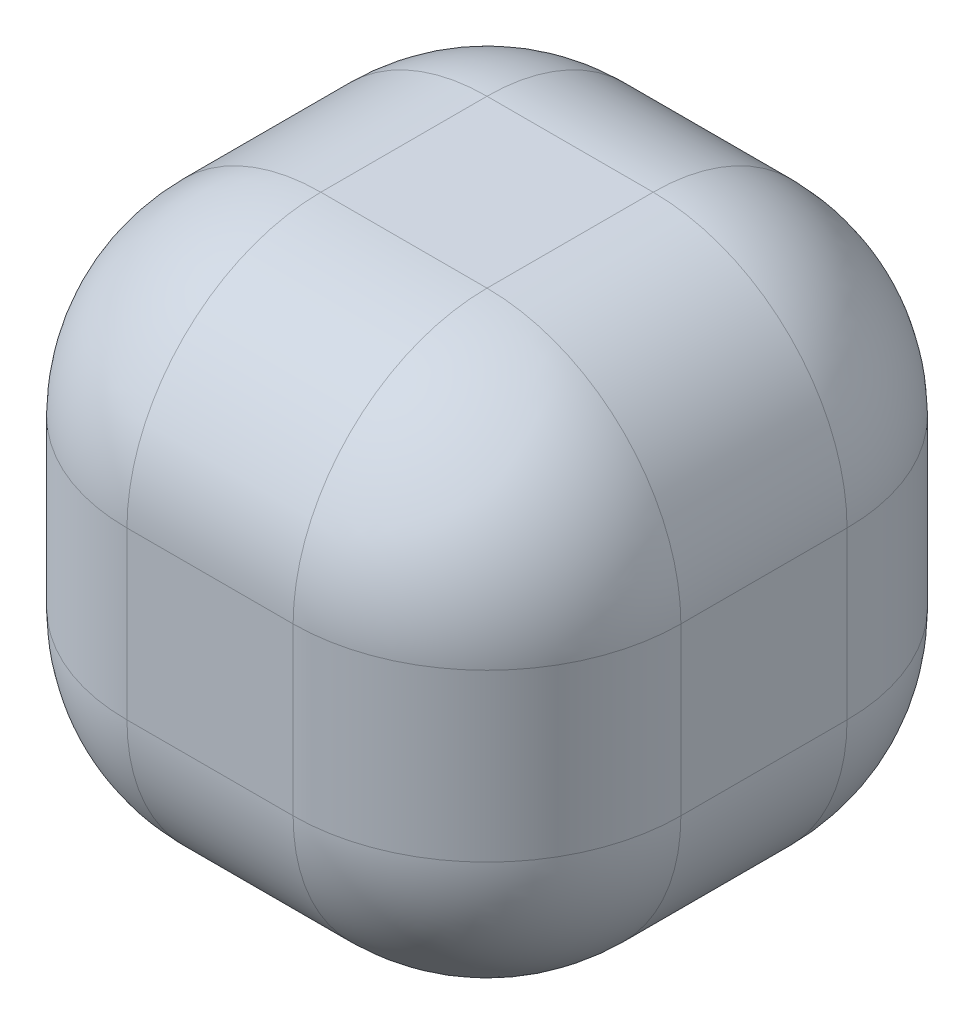
ISO-10303-21;
HEADER;
FILE_DESCRIPTION(('STEP AP214'),'2;1');
FILE_NAME('part.step','',(''),(''),'','','');
FILE_SCHEMA(('AUTOMOTIVE_DESIGN { 1 0 10303 214 1 1 1 1 }'));
ENDSEC;
DATA;
#1=APPLICATION_CONTEXT('core data for automotive mechanical design processes');
#2=APPLICATION_PROTOCOL_DEFINITION('international standard','automotive_design',2000,#1);
#3=PRODUCT_CONTEXT('',#1,'mechanical');
#4=PRODUCT('Part','Part','',(#3));
#5=PRODUCT_RELATED_PRODUCT_CATEGORY('part','',(#4));
#6=PRODUCT_DEFINITION_FORMATION('','',#4);
#7=PRODUCT_DEFINITION_CONTEXT('part definition',#1,'design');
#8=PRODUCT_DEFINITION('design','',#6,#7);
#9=PRODUCT_DEFINITION_SHAPE('','',#8);
#10=(LENGTH_UNIT() NAMED_UNIT(*) SI_UNIT(.MILLI.,.METRE.));
#11=(NAMED_UNIT(*) PLANE_ANGLE_UNIT() SI_UNIT($,.RADIAN.));
#12=(NAMED_UNIT(*) SI_UNIT($,.STERADIAN.) SOLID_ANGLE_UNIT());
#13=UNCERTAINTY_MEASURE_WITH_UNIT(LENGTH_MEASURE(1.E-05),#10,'distance_accuracy_value','');
#14=(GEOMETRIC_REPRESENTATION_CONTEXT(3) GLOBAL_UNCERTAINTY_ASSIGNED_CONTEXT((#13)) GLOBAL_UNIT_ASSIGNED_CONTEXT((#10,
#11,#12)) REPRESENTATION_CONTEXT('',''));
#15=CARTESIAN_POINT('',(0.,0.,0.));
#16=DIRECTION('',(0.,0.,1.));
#17=DIRECTION('',(1.,0.,0.));
#18=AXIS2_PLACEMENT_3D('',#15,#16,#17);
#19=CARTESIAN_POINT('',(20.,40.,20.));
#20=DIRECTION('',(-1.,0.,0.));
#21=DIRECTION('',(0.,0.,1.));
#22=AXIS2_PLACEMENT_3D('',#19,#20,#21);
#23=PLANE('',#22);
#24=DIRECTION('',(0.,-1.,0.));
#25=VECTOR('',#24,1.);
#26=CARTESIAN_POINT('',(20.,40.,-6.00000000000001));
#27=LINE('',#26,#25);
#28=CARTESIAN_POINT('',(20.,14.,-6.));
#29=VERTEX_POINT('',#28);
#30=CARTESIAN_POINT('',(20.,26.,-6.));
#31=VERTEX_POINT('',#30);
#32=EDGE_CURVE('E171',#29,#31,#27,.F.);
#33=ORIENTED_EDGE('',*,*,#32,.T.);
#34=DIRECTION('',(0.,0.,-1.));
#35=VECTOR('',#34,1.);
#36=CARTESIAN_POINT('',(20.,26.,20.));
#37=LINE('',#36,#35);
#38=CARTESIAN_POINT('',(20.,26.,6.));
#39=VERTEX_POINT('',#38);
#40=EDGE_CURVE('E174',#31,#39,#37,.F.);
#41=ORIENTED_EDGE('',*,*,#40,.T.);
#42=DIRECTION('',(0.,-1.,0.));
#43=VECTOR('',#42,1.);
#44=CARTESIAN_POINT('',(20.,40.,6.));
#45=LINE('',#44,#43);
#46=CARTESIAN_POINT('',(20.,14.,6.));
#47=VERTEX_POINT('',#46);
#48=EDGE_CURVE('E169',#39,#47,#45,.T.);
#49=ORIENTED_EDGE('',*,*,#48,.T.);
#50=DIRECTION('',(0.,0.,-1.));
#51=VECTOR('',#50,1.);
#52=CARTESIAN_POINT('',(20.,14.,-20.));
#53=LINE('',#52,#51);
#54=EDGE_CURVE('E167',#47,#29,#53,.T.);
#55=ORIENTED_EDGE('',*,*,#54,.T.);
#56=EDGE_LOOP('',(#33,#41,#49,#55));
#57=FACE_BOUND('',#56,.T.);
#58=ADVANCED_FACE('F36',(#57),#23,.F.);
#59=CARTESIAN_POINT('',(-20.,40.,-20.));
#60=DIRECTION('',(0.,0.,1.));
#61=DIRECTION('',(1.,0.,0.));
#62=AXIS2_PLACEMENT_3D('',#59,#60,#61);
#63=PLANE('',#62);
#64=DIRECTION('',(0.,-1.,0.));
#65=VECTOR('',#64,1.);
#66=CARTESIAN_POINT('',(-5.99999999999999,40.,-20.));
#67=LINE('',#66,#65);
#68=CARTESIAN_POINT('',(-5.99999999999999,14.,-20.));
#69=VERTEX_POINT('',#68);
#70=CARTESIAN_POINT('',(-5.99999999999999,26.,-20.));
#71=VERTEX_POINT('',#70);
#72=EDGE_CURVE('E133',#69,#71,#67,.F.);
#73=ORIENTED_EDGE('',*,*,#72,.T.);
#74=DIRECTION('',(-1.,0.,0.));
#75=VECTOR('',#74,1.);
#76=CARTESIAN_POINT('',(-20.,26.,-20.));
#77=LINE('',#76,#75);
#78=CARTESIAN_POINT('',(6.00000000000001,26.,-20.));
#79=VERTEX_POINT('',#78);
#80=EDGE_CURVE('E165',#71,#79,#77,.F.);
#81=ORIENTED_EDGE('',*,*,#80,.T.);
#82=DIRECTION('',(0.,-1.,0.));
#83=VECTOR('',#82,1.);
#84=CARTESIAN_POINT('',(6.00000000000001,40.,-20.));
#85=LINE('',#84,#83);
#86=CARTESIAN_POINT('',(6.00000000000001,14.,-20.));
#87=VERTEX_POINT('',#86);
#88=EDGE_CURVE('E162',#79,#87,#85,.T.);
#89=ORIENTED_EDGE('',*,*,#88,.T.);
#90=DIRECTION('',(-1.,0.,0.));
#91=VECTOR('',#90,1.);
#92=CARTESIAN_POINT('',(-20.,14.,-20.));
#93=LINE('',#92,#91);
#94=EDGE_CURVE('E157',#87,#69,#93,.T.);
#95=ORIENTED_EDGE('',*,*,#94,.T.);
#96=EDGE_LOOP('',(#73,#81,#89,#95));
#97=FACE_BOUND('',#96,.T.);
#98=ADVANCED_FACE('F329',(#97),#63,.F.);
#99=CARTESIAN_POINT('',(-20.,40.,20.));
#100=DIRECTION('',(1.,0.,0.));
#101=DIRECTION('',(0.,0.,-1.));
#102=AXIS2_PLACEMENT_3D('',#99,#100,#101);
#103=PLANE('',#102);
#104=DIRECTION('',(0.,-1.,0.));
#105=VECTOR('',#104,1.);
#106=CARTESIAN_POINT('',(-20.,40.,6.));
#107=LINE('',#106,#105);
#108=CARTESIAN_POINT('',(-20.,14.,6.));
#109=VERTEX_POINT('',#108);
#110=CARTESIAN_POINT('',(-20.,26.,6.));
#111=VERTEX_POINT('',#110);
#112=EDGE_CURVE('E150',#109,#111,#107,.F.);
#113=ORIENTED_EDGE('',*,*,#112,.T.);
#114=DIRECTION('',(0.,0.,1.));
#115=VECTOR('',#114,1.);
#116=CARTESIAN_POINT('',(-20.,26.,20.));
#117=LINE('',#116,#115);
#118=CARTESIAN_POINT('',(-20.,26.,-6.00000000000001));
#119=VERTEX_POINT('',#118);
#120=EDGE_CURVE('E154',#111,#119,#117,.F.);
#121=ORIENTED_EDGE('',*,*,#120,.T.);
#122=DIRECTION('',(0.,-1.,0.));
#123=VECTOR('',#122,1.);
#124=CARTESIAN_POINT('',(-20.,40.,-6.00000000000001));
#125=LINE('',#124,#123);
#126=CARTESIAN_POINT('',(-20.,14.,-6.00000000000001));
#127=VERTEX_POINT('',#126);
#128=EDGE_CURVE('E131',#119,#127,#125,.T.);
#129=ORIENTED_EDGE('',*,*,#128,.T.);
#130=DIRECTION('',(0.,0.,1.));
#131=VECTOR('',#130,1.);
#132=CARTESIAN_POINT('',(-20.,14.,20.));
#133=LINE('',#132,#131);
#134=EDGE_CURVE('E144',#127,#109,#133,.T.);
#135=ORIENTED_EDGE('',*,*,#134,.T.);
#136=EDGE_LOOP('',(#113,#121,#129,#135));
#137=FACE_BOUND('',#136,.T.);
#138=ADVANCED_FACE('F152',(#137),#103,.F.);
#139=CARTESIAN_POINT('',(-20.,40.,20.));
#140=DIRECTION('',(0.,0.,-1.));
#141=DIRECTION('',(-1.,0.,0.));
#142=AXIS2_PLACEMENT_3D('',#139,#140,#141);
#143=PLANE('',#142);
#144=DIRECTION('',(0.,-1.,0.));
#145=VECTOR('',#144,1.);
#146=CARTESIAN_POINT('',(6.00000000000001,40.,20.));
#147=LINE('',#146,#145);
#148=CARTESIAN_POINT('',(6.00000000000001,14.,20.));
#149=VERTEX_POINT('',#148);
#150=CARTESIAN_POINT('',(6.00000000000001,26.,20.));
#151=VERTEX_POINT('',#150);
#152=EDGE_CURVE('E180',#149,#151,#147,.F.);
#153=ORIENTED_EDGE('',*,*,#152,.T.);
#154=DIRECTION('',(1.,0.,0.));
#155=VECTOR('',#154,1.);
#156=CARTESIAN_POINT('',(-20.,26.,20.));
#157=LINE('',#156,#155);
#158=CARTESIAN_POINT('',(-5.99999999999999,26.,20.));
#159=VERTEX_POINT('',#158);
#160=EDGE_CURVE('E183',#151,#159,#157,.F.);
#161=ORIENTED_EDGE('',*,*,#160,.T.);
#162=DIRECTION('',(0.,-1.,0.));
#163=VECTOR('',#162,1.);
#164=CARTESIAN_POINT('',(-5.99999999999999,40.,20.));
#165=LINE('',#164,#163);
#166=CARTESIAN_POINT('',(-5.99999999999999,14.,20.));
#167=VERTEX_POINT('',#166);
#168=EDGE_CURVE('E178',#159,#167,#165,.T.);
#169=ORIENTED_EDGE('',*,*,#168,.T.);
#170=DIRECTION('',(1.,0.,0.));
#171=VECTOR('',#170,1.);
#172=CARTESIAN_POINT('',(20.,14.,20.));
#173=LINE('',#172,#171);
#174=EDGE_CURVE('E176',#167,#149,#173,.T.);
#175=ORIENTED_EDGE('',*,*,#174,.T.);
#176=EDGE_LOOP('',(#153,#161,#169,#175));
#177=FACE_BOUND('',#176,.T.);
#178=ADVANCED_FACE('F280',(#177),#143,.F.);
#179=CARTESIAN_POINT('',(0.,40.,0.));
#180=DIRECTION('',(0.,-1.,0.));
#181=DIRECTION('',(0.,0.,-1.));
#182=AXIS2_PLACEMENT_3D('',#179,#180,#181);
#183=PLANE('',#182);
#184=DIRECTION('',(-1.,0.,0.));
#185=VECTOR('',#184,1.);
#186=CARTESIAN_POINT('',(0.,40.,-6.));
#187=LINE('',#186,#185);
#188=CARTESIAN_POINT('',(6.00000000000001,40.,-6.));
#189=VERTEX_POINT('',#188);
#190=CARTESIAN_POINT('',(-5.99999999999999,40.,-6.));
#191=VERTEX_POINT('',#190);
#192=EDGE_CURVE('E185',#189,#191,#187,.T.);
#193=ORIENTED_EDGE('',*,*,#192,.T.);
#194=DIRECTION('',(0.,0.,1.));
#195=VECTOR('',#194,1.);
#196=CARTESIAN_POINT('',(-5.99999999999999,40.,0.));
#197=LINE('',#196,#195);
#198=CARTESIAN_POINT('',(-5.99999999999999,40.,6.));
#199=VERTEX_POINT('',#198);
#200=EDGE_CURVE('E191',#191,#199,#197,.T.);
#201=ORIENTED_EDGE('',*,*,#200,.T.);
#202=DIRECTION('',(1.,0.,0.));
#203=VECTOR('',#202,1.);
#204=CARTESIAN_POINT('',(0.,40.,6.));
#205=LINE('',#204,#203);
#206=CARTESIAN_POINT('',(6.00000000000001,40.,6.));
#207=VERTEX_POINT('',#206);
#208=EDGE_CURVE('E189',#199,#207,#205,.T.);
#209=ORIENTED_EDGE('',*,*,#208,.T.);
#210=DIRECTION('',(0.,0.,-1.));
#211=VECTOR('',#210,1.);
#212=CARTESIAN_POINT('',(6.00000000000001,40.,0.));
#213=LINE('',#212,#211);
#214=EDGE_CURVE('E187',#207,#189,#213,.T.);
#215=ORIENTED_EDGE('',*,*,#214,.T.);
#216=EDGE_LOOP('',(#193,#201,#209,#215));
#217=FACE_BOUND('',#216,.T.);
#218=ADVANCED_FACE('F271',(#217),#183,.F.);
#219=CARTESIAN_POINT('',(0.,0.,0.));
#220=DIRECTION('',(0.,-1.,0.));
#221=DIRECTION('',(0.,0.,-1.));
#222=AXIS2_PLACEMENT_3D('',#219,#220,#221);
#223=PLANE('',#222);
#224=DIRECTION('',(1.,0.,0.));
#225=VECTOR('',#224,1.);
#226=CARTESIAN_POINT('',(-20.,0.,6.));
#227=LINE('',#226,#225);
#228=CARTESIAN_POINT('',(6.00000000000001,0.,6.));
#229=VERTEX_POINT('',#228);
#230=CARTESIAN_POINT('',(-5.99999999999999,0.,6.));
#231=VERTEX_POINT('',#230);
#232=EDGE_CURVE('E194',#229,#231,#227,.F.);
#233=ORIENTED_EDGE('',*,*,#232,.T.);
#234=DIRECTION('',(0.,0.,1.));
#235=VECTOR('',#234,1.);
#236=CARTESIAN_POINT('',(-5.99999999999999,0.,-20.));
#237=LINE('',#236,#235);
#238=CARTESIAN_POINT('',(-5.99999999999999,0.,-6.));
#239=VERTEX_POINT('',#238);
#240=EDGE_CURVE('E11',#231,#239,#237,.F.);
#241=ORIENTED_EDGE('',*,*,#240,.T.);
#242=DIRECTION('',(-1.,0.,0.));
#243=VECTOR('',#242,1.);
#244=CARTESIAN_POINT('',(20.,0.,-6.));
#245=LINE('',#244,#243);
#246=CARTESIAN_POINT('',(6.00000000000001,0.,-6.));
#247=VERTEX_POINT('',#246);
#248=EDGE_CURVE('E45',#239,#247,#245,.F.);
#249=ORIENTED_EDGE('',*,*,#248,.T.);
#250=DIRECTION('',(0.,0.,-1.));
#251=VECTOR('',#250,1.);
#252=CARTESIAN_POINT('',(6.00000000000001,0.,20.));
#253=LINE('',#252,#251);
#254=EDGE_CURVE('E196',#247,#229,#253,.F.);
#255=ORIENTED_EDGE('',*,*,#254,.T.);
#256=EDGE_LOOP('',(#233,#241,#249,#255));
#257=FACE_BOUND('',#256,.T.);
#258=ADVANCED_FACE('F359',(#257),#223,.T.);
#259=CARTESIAN_POINT('',(6.00000000000001,40.,6.));
#260=DIRECTION('',(0.,-1.,0.));
#261=DIRECTION('',(0.,0.,-1.));
#262=AXIS2_PLACEMENT_3D('',#259,#260,#261);
#263=CYLINDRICAL_SURFACE('',#262,14.);
#264=CARTESIAN_POINT('',(6.00000000000001,26.,6.));
#265=DIRECTION('',(0.,1.,0.));
#266=DIRECTION('',(0.,0.,1.));
#267=AXIS2_PLACEMENT_3D('',#264,#265,#266);
#268=CIRCLE('',#267,14.);
#269=EDGE_CURVE('E40',#151,#39,#268,.T.);
#270=ORIENTED_EDGE('',*,*,#269,.F.);
#271=ORIENTED_EDGE('',*,*,#152,.F.);
#272=CARTESIAN_POINT('',(6.00000000000001,14.,6.));
#273=DIRECTION('',(0.,-1.,0.));
#274=DIRECTION('',(0.,0.,-1.));
#275=AXIS2_PLACEMENT_3D('',#272,#273,#274);
#276=CIRCLE('',#275,14.);
#277=EDGE_CURVE('E249',#47,#149,#276,.T.);
#278=ORIENTED_EDGE('',*,*,#277,.F.);
#279=ORIENTED_EDGE('',*,*,#48,.F.);
#280=EDGE_LOOP('',(#270,#271,#278,#279));
#281=FACE_BOUND('',#280,.T.);
#282=ADVANCED_FACE('F38',(#281),#263,.T.);
#283=CARTESIAN_POINT('',(6.00000000000001,26.,6.));
#284=DIRECTION('',(0.,0.,1.));
#285=DIRECTION('',(1.,0.,0.));
#286=AXIS2_PLACEMENT_3D('',#283,#284,#285);
#287=SPHERICAL_SURFACE('',#286,14.);
#288=CARTESIAN_POINT('',(6.00000000000001,26.,6.));
#289=DIRECTION('',(1.,0.,0.));
#290=DIRECTION('',(0.,0.,-1.));
#291=AXIS2_PLACEMENT_3D('',#288,#289,#290);
#292=CIRCLE('',#291,14.);
#293=EDGE_CURVE('E244',#151,#207,#292,.F.);
#294=ORIENTED_EDGE('',*,*,#293,.F.);
#295=ORIENTED_EDGE('',*,*,#269,.T.);
#296=CARTESIAN_POINT('',(6.00000000000001,26.,6.));
#297=DIRECTION('',(0.,0.,1.));
#298=DIRECTION('',(1.,0.,0.));
#299=AXIS2_PLACEMENT_3D('',#296,#297,#298);
#300=CIRCLE('',#299,14.);
#301=EDGE_CURVE('E247',#207,#39,#300,.F.);
#302=ORIENTED_EDGE('',*,*,#301,.F.);
#303=EDGE_LOOP('',(#294,#295,#302));
#304=FACE_BOUND('',#303,.T.);
#305=ADVANCED_FACE('F260',(#304),#287,.T.);
#306=CARTESIAN_POINT('',(6.00000000000001,14.,6.));
#307=DIRECTION('',(0.,0.,1.));
#308=DIRECTION('',(1.,0.,0.));
#309=AXIS2_PLACEMENT_3D('',#306,#307,#308);
#310=SPHERICAL_SURFACE('',#309,14.);
#311=CARTESIAN_POINT('',(6.00000000000001,14.,6.));
#312=DIRECTION('',(0.,0.,1.));
#313=DIRECTION('',(1.,0.,0.));
#314=AXIS2_PLACEMENT_3D('',#311,#312,#313);
#315=CIRCLE('',#314,14.);
#316=EDGE_CURVE('E238',#47,#229,#315,.F.);
#317=ORIENTED_EDGE('',*,*,#316,.F.);
#318=ORIENTED_EDGE('',*,*,#277,.T.);
#319=CARTESIAN_POINT('',(6.00000000000001,14.,6.));
#320=DIRECTION('',(1.,0.,0.));
#321=DIRECTION('',(0.,0.,-1.));
#322=AXIS2_PLACEMENT_3D('',#319,#320,#321);
#323=CIRCLE('',#322,14.);
#324=EDGE_CURVE('E241',#229,#149,#323,.F.);
#325=ORIENTED_EDGE('',*,*,#324,.F.);
#326=EDGE_LOOP('',(#317,#318,#325));
#327=FACE_BOUND('',#326,.T.);
#328=ADVANCED_FACE('F294',(#327),#310,.T.);
#329=CARTESIAN_POINT('',(6.00000000000001,26.,0.));
#330=DIRECTION('',(0.,0.,-1.));
#331=DIRECTION('',(-1.,0.,0.));
#332=AXIS2_PLACEMENT_3D('',#329,#330,#331);
#333=CYLINDRICAL_SURFACE('',#332,14.);
#334=ORIENTED_EDGE('',*,*,#301,.T.);
#335=ORIENTED_EDGE('',*,*,#40,.F.);
#336=CARTESIAN_POINT('',(6.00000000000001,26.,-6.));
#337=DIRECTION('',(0.,0.,-1.));
#338=DIRECTION('',(-1.,0.,0.));
#339=AXIS2_PLACEMENT_3D('',#336,#337,#338);
#340=CIRCLE('',#339,14.);
#341=EDGE_CURVE('E233',#189,#31,#340,.T.);
#342=ORIENTED_EDGE('',*,*,#341,.F.);
#343=ORIENTED_EDGE('',*,*,#214,.F.);
#344=EDGE_LOOP('',(#334,#335,#342,#343));
#345=FACE_BOUND('',#344,.T.);
#346=ADVANCED_FACE('F267',(#345),#333,.T.);
#347=CARTESIAN_POINT('',(0.,26.,6.));
#348=DIRECTION('',(1.,0.,0.));
#349=DIRECTION('',(0.,0.,-1.));
#350=AXIS2_PLACEMENT_3D('',#347,#348,#349);
#351=CYLINDRICAL_SURFACE('',#350,14.);
#352=ORIENTED_EDGE('',*,*,#293,.T.);
#353=ORIENTED_EDGE('',*,*,#208,.F.);
#354=CARTESIAN_POINT('',(-5.99999999999999,26.,6.));
#355=DIRECTION('',(-1.,0.,0.));
#356=DIRECTION('',(0.,0.,1.));
#357=AXIS2_PLACEMENT_3D('',#354,#355,#356);
#358=CIRCLE('',#357,14.);
#359=EDGE_CURVE('E230',#159,#199,#358,.T.);
#360=ORIENTED_EDGE('',*,*,#359,.F.);
#361=ORIENTED_EDGE('',*,*,#160,.F.);
#362=EDGE_LOOP('',(#352,#353,#360,#361));
#363=FACE_BOUND('',#362,.T.);
#364=ADVANCED_FACE('F277',(#363),#351,.T.);
#365=CARTESIAN_POINT('',(-5.99999999999999,40.,6.));
#366=DIRECTION('',(0.,-1.,0.));
#367=DIRECTION('',(0.,0.,-1.));
#368=AXIS2_PLACEMENT_3D('',#365,#366,#367);
#369=CYLINDRICAL_SURFACE('',#368,14.);
#370=CARTESIAN_POINT('',(-5.99999999999999,14.,6.));
#371=DIRECTION('',(0.,-1.,0.));
#372=DIRECTION('',(0.,0.,-1.));
#373=AXIS2_PLACEMENT_3D('',#370,#371,#372);
#374=CIRCLE('',#373,14.);
#375=EDGE_CURVE('E224',#167,#109,#374,.T.);
#376=ORIENTED_EDGE('',*,*,#375,.F.);
#377=ORIENTED_EDGE('',*,*,#168,.F.);
#378=CARTESIAN_POINT('',(-5.99999999999999,26.,6.));
#379=DIRECTION('',(0.,1.,0.));
#380=DIRECTION('',(0.,0.,1.));
#381=AXIS2_PLACEMENT_3D('',#378,#379,#380);
#382=CIRCLE('',#381,14.);
#383=EDGE_CURVE('E227',#111,#159,#382,.T.);
#384=ORIENTED_EDGE('',*,*,#383,.F.);
#385=ORIENTED_EDGE('',*,*,#112,.F.);
#386=EDGE_LOOP('',(#376,#377,#384,#385));
#387=FACE_BOUND('',#386,.T.);
#388=ADVANCED_FACE('F285',(#387),#369,.T.);
#389=CARTESIAN_POINT('',(-20.,14.,6.));
#390=DIRECTION('',(-1.,0.,0.));
#391=DIRECTION('',(0.,0.,1.));
#392=AXIS2_PLACEMENT_3D('',#389,#390,#391);
#393=CYLINDRICAL_SURFACE('',#392,14.);
#394=ORIENTED_EDGE('',*,*,#324,.T.);
#395=ORIENTED_EDGE('',*,*,#174,.F.);
#396=CARTESIAN_POINT('',(-5.99999999999999,14.,6.));
#397=DIRECTION('',(-1.,0.,0.));
#398=DIRECTION('',(0.,0.,1.));
#399=AXIS2_PLACEMENT_3D('',#396,#397,#398);
#400=CIRCLE('',#399,14.);
#401=EDGE_CURVE('E221',#231,#167,#400,.T.);
#402=ORIENTED_EDGE('',*,*,#401,.F.);
#403=ORIENTED_EDGE('',*,*,#232,.F.);
#404=EDGE_LOOP('',(#394,#395,#402,#403));
#405=FACE_BOUND('',#404,.T.);
#406=ADVANCED_FACE('F292',(#405),#393,.T.);
#407=CARTESIAN_POINT('',(6.00000000000001,14.,20.));
#408=DIRECTION('',(0.,0.,1.));
#409=DIRECTION('',(1.,0.,0.));
#410=AXIS2_PLACEMENT_3D('',#407,#408,#409);
#411=CYLINDRICAL_SURFACE('',#410,14.);
#412=ORIENTED_EDGE('',*,*,#316,.T.);
#413=ORIENTED_EDGE('',*,*,#254,.F.);
#414=CARTESIAN_POINT('',(6.00000000000001,14.,-6.));
#415=DIRECTION('',(0.,0.,-1.));
#416=DIRECTION('',(-1.,0.,0.));
#417=AXIS2_PLACEMENT_3D('',#414,#415,#416);
#418=CIRCLE('',#417,14.);
#419=EDGE_CURVE('E218',#29,#247,#418,.T.);
#420=ORIENTED_EDGE('',*,*,#419,.F.);
#421=ORIENTED_EDGE('',*,*,#54,.F.);
#422=EDGE_LOOP('',(#412,#413,#420,#421));
#423=FACE_BOUND('',#422,.T.);
#424=ADVANCED_FACE('F297',(#423),#411,.T.);
#425=CARTESIAN_POINT('',(6.00000000000001,40.,-6.));
#426=DIRECTION('',(0.,-1.,0.));
#427=DIRECTION('',(0.,0.,-1.));
#428=AXIS2_PLACEMENT_3D('',#425,#426,#427);
#429=CYLINDRICAL_SURFACE('',#428,14.);
#430=CARTESIAN_POINT('',(6.00000000000001,26.,-6.));
#431=DIRECTION('',(0.,1.,0.));
#432=DIRECTION('',(0.,0.,1.));
#433=AXIS2_PLACEMENT_3D('',#430,#431,#432);
#434=CIRCLE('',#433,14.);
#435=EDGE_CURVE('E235',#31,#79,#434,.T.);
#436=ORIENTED_EDGE('',*,*,#435,.F.);
#437=ORIENTED_EDGE('',*,*,#32,.F.);
#438=CARTESIAN_POINT('',(6.00000000000001,14.,-6.));
#439=DIRECTION('',(0.,-1.,0.));
#440=DIRECTION('',(0.,0.,-1.));
#441=AXIS2_PLACEMENT_3D('',#438,#439,#440);
#442=CIRCLE('',#441,14.);
#443=EDGE_CURVE('E215',#87,#29,#442,.T.);
#444=ORIENTED_EDGE('',*,*,#443,.F.);
#445=ORIENTED_EDGE('',*,*,#88,.F.);
#446=EDGE_LOOP('',(#436,#437,#444,#445));
#447=FACE_BOUND('',#446,.T.);
#448=ADVANCED_FACE('F303',(#447),#429,.T.);
#449=CARTESIAN_POINT('',(6.00000000000001,26.,-6.));
#450=DIRECTION('',(0.,0.,1.));
#451=DIRECTION('',(1.,0.,0.));
#452=AXIS2_PLACEMENT_3D('',#449,#450,#451);
#453=SPHERICAL_SURFACE('',#452,14.);
#454=ORIENTED_EDGE('',*,*,#341,.T.);
#455=ORIENTED_EDGE('',*,*,#435,.T.);
#456=CARTESIAN_POINT('',(6.00000000000001,26.,-6.));
#457=DIRECTION('',(1.,0.,0.));
#458=DIRECTION('',(0.,1.,0.));
#459=AXIS2_PLACEMENT_3D('',#456,#457,#458);
#460=CIRCLE('',#459,14.);
#461=EDGE_CURVE('E212',#189,#79,#460,.F.);
#462=ORIENTED_EDGE('',*,*,#461,.F.);
#463=EDGE_LOOP('',(#454,#455,#462));
#464=FACE_BOUND('',#463,.T.);
#465=ADVANCED_FACE('F307',(#464),#453,.T.);
#466=CARTESIAN_POINT('',(-5.99999999999999,26.,6.));
#467=DIRECTION('',(0.,0.,1.));
#468=DIRECTION('',(1.,0.,0.));
#469=AXIS2_PLACEMENT_3D('',#466,#467,#468);
#470=SPHERICAL_SURFACE('',#469,14.);
#471=ORIENTED_EDGE('',*,*,#383,.T.);
#472=ORIENTED_EDGE('',*,*,#359,.T.);
#473=CARTESIAN_POINT('',(-5.99999999999999,26.,6.));
#474=DIRECTION('',(0.,0.,1.));
#475=DIRECTION('',(1.,0.,0.));
#476=AXIS2_PLACEMENT_3D('',#473,#474,#475);
#477=CIRCLE('',#476,14.);
#478=EDGE_CURVE('E210',#111,#199,#477,.F.);
#479=ORIENTED_EDGE('',*,*,#478,.F.);
#480=EDGE_LOOP('',(#471,#472,#479));
#481=FACE_BOUND('',#480,.T.);
#482=ADVANCED_FACE('F318',(#481),#470,.T.);
#483=CARTESIAN_POINT('',(-5.99999999999999,14.,6.));
#484=DIRECTION('',(0.,0.,1.));
#485=DIRECTION('',(1.,0.,0.));
#486=AXIS2_PLACEMENT_3D('',#483,#484,#485);
#487=SPHERICAL_SURFACE('',#486,14.);
#488=ORIENTED_EDGE('',*,*,#401,.T.);
#489=ORIENTED_EDGE('',*,*,#375,.T.);
#490=CARTESIAN_POINT('',(-5.99999999999999,14.,6.));
#491=DIRECTION('',(0.,0.,1.));
#492=DIRECTION('',(1.,0.,0.));
#493=AXIS2_PLACEMENT_3D('',#490,#491,#492);
#494=CIRCLE('',#493,14.);
#495=EDGE_CURVE('E147',#231,#109,#494,.F.);
#496=ORIENTED_EDGE('',*,*,#495,.F.);
#497=EDGE_LOOP('',(#488,#489,#496));
#498=FACE_BOUND('',#497,.T.);
#499=ADVANCED_FACE('F289',(#498),#487,.T.);
#500=CARTESIAN_POINT('',(6.00000000000001,14.,-6.));
#501=DIRECTION('',(0.,0.,1.));
#502=DIRECTION('',(1.,0.,0.));
#503=AXIS2_PLACEMENT_3D('',#500,#501,#502);
#504=SPHERICAL_SURFACE('',#503,14.);
#505=ORIENTED_EDGE('',*,*,#443,.T.);
#506=ORIENTED_EDGE('',*,*,#419,.T.);
#507=CARTESIAN_POINT('',(6.00000000000001,14.,-6.));
#508=DIRECTION('',(1.,0.,0.));
#509=DIRECTION('',(0.,0.,-1.));
#510=AXIS2_PLACEMENT_3D('',#507,#508,#509);
#511=CIRCLE('',#510,14.);
#512=EDGE_CURVE('E206',#87,#247,#511,.F.);
#513=ORIENTED_EDGE('',*,*,#512,.F.);
#514=EDGE_LOOP('',(#505,#506,#513));
#515=FACE_BOUND('',#514,.T.);
#516=ADVANCED_FACE('F325',(#515),#504,.T.);
#517=CARTESIAN_POINT('',(0.,26.,-6.));
#518=DIRECTION('',(-1.,0.,0.));
#519=DIRECTION('',(0.,0.,1.));
#520=AXIS2_PLACEMENT_3D('',#517,#518,#519);
#521=CYLINDRICAL_SURFACE('',#520,14.);
#522=ORIENTED_EDGE('',*,*,#461,.T.);
#523=ORIENTED_EDGE('',*,*,#80,.F.);
#524=CARTESIAN_POINT('',(-5.99999999999999,26.,-6.));
#525=DIRECTION('',(-1.,0.,0.));
#526=DIRECTION('',(0.,0.,1.));
#527=AXIS2_PLACEMENT_3D('',#524,#525,#526);
#528=CIRCLE('',#527,14.);
#529=EDGE_CURVE('E203',#191,#71,#528,.T.);
#530=ORIENTED_EDGE('',*,*,#529,.F.);
#531=ORIENTED_EDGE('',*,*,#192,.F.);
#532=EDGE_LOOP('',(#522,#523,#530,#531));
#533=FACE_BOUND('',#532,.T.);
#534=ADVANCED_FACE('F310',(#533),#521,.T.);
#535=CARTESIAN_POINT('',(-5.99999999999999,26.,0.));
#536=DIRECTION('',(0.,0.,1.));
#537=DIRECTION('',(1.,0.,0.));
#538=AXIS2_PLACEMENT_3D('',#535,#536,#537);
#539=CYLINDRICAL_SURFACE('',#538,14.);
#540=ORIENTED_EDGE('',*,*,#478,.T.);
#541=ORIENTED_EDGE('',*,*,#200,.F.);
#542=CARTESIAN_POINT('',(-5.99999999999999,26.,-6.00000000000001));
#543=DIRECTION('',(0.,0.,-1.));
#544=DIRECTION('',(0.,1.,0.));
#545=AXIS2_PLACEMENT_3D('',#542,#543,#544);
#546=CIRCLE('',#545,14.);
#547=EDGE_CURVE('E141',#119,#191,#546,.T.);
#548=ORIENTED_EDGE('',*,*,#547,.F.);
#549=ORIENTED_EDGE('',*,*,#120,.F.);
#550=EDGE_LOOP('',(#540,#541,#548,#549));
#551=FACE_BOUND('',#550,.T.);
#552=ADVANCED_FACE('F316',(#551),#539,.T.);
#553=CARTESIAN_POINT('',(-5.99999999999999,14.,20.));
#554=DIRECTION('',(0.,0.,-1.));
#555=DIRECTION('',(-1.,0.,0.));
#556=AXIS2_PLACEMENT_3D('',#553,#554,#555);
#557=CYLINDRICAL_SURFACE('',#556,14.);
#558=ORIENTED_EDGE('',*,*,#495,.T.);
#559=ORIENTED_EDGE('',*,*,#134,.F.);
#560=CARTESIAN_POINT('',(-5.99999999999999,14.,-6.));
#561=DIRECTION('',(0.,0.,-1.));
#562=DIRECTION('',(-1.,0.,0.));
#563=AXIS2_PLACEMENT_3D('',#560,#561,#562);
#564=CIRCLE('',#563,14.);
#565=EDGE_CURVE('E136',#239,#127,#564,.T.);
#566=ORIENTED_EDGE('',*,*,#565,.F.);
#567=ORIENTED_EDGE('',*,*,#240,.F.);
#568=EDGE_LOOP('',(#558,#559,#566,#567));
#569=FACE_BOUND('',#568,.T.);
#570=ADVANCED_FACE('F145',(#569),#557,.T.);
#571=CARTESIAN_POINT('',(-20.,14.,-6.));
#572=DIRECTION('',(1.,0.,0.));
#573=DIRECTION('',(0.,0.,-1.));
#574=AXIS2_PLACEMENT_3D('',#571,#572,#573);
#575=CYLINDRICAL_SURFACE('',#574,14.);
#576=ORIENTED_EDGE('',*,*,#512,.T.);
#577=ORIENTED_EDGE('',*,*,#248,.F.);
#578=CARTESIAN_POINT('',(-5.99999999999999,14.,-6.));
#579=DIRECTION('',(-1.,0.,0.));
#580=DIRECTION('',(0.,0.,1.));
#581=AXIS2_PLACEMENT_3D('',#578,#579,#580);
#582=CIRCLE('',#581,14.);
#583=EDGE_CURVE('E53',#69,#239,#582,.T.);
#584=ORIENTED_EDGE('',*,*,#583,.F.);
#585=ORIENTED_EDGE('',*,*,#94,.F.);
#586=EDGE_LOOP('',(#576,#577,#584,#585));
#587=FACE_BOUND('',#586,.T.);
#588=ADVANCED_FACE('F344',(#587),#575,.T.);
#589=CARTESIAN_POINT('',(-5.99999999999999,26.,-6.));
#590=DIRECTION('',(0.,0.,1.));
#591=DIRECTION('',(1.,0.,0.));
#592=AXIS2_PLACEMENT_3D('',#589,#590,#591);
#593=SPHERICAL_SURFACE('',#592,14.);
#594=ORIENTED_EDGE('',*,*,#547,.T.);
#595=ORIENTED_EDGE('',*,*,#529,.T.);
#596=CARTESIAN_POINT('',(-5.99999999999999,26.,-6.));
#597=DIRECTION('',(0.,1.,0.));
#598=DIRECTION('',(0.,0.,1.));
#599=AXIS2_PLACEMENT_3D('',#596,#597,#598);
#600=CIRCLE('',#599,14.);
#601=EDGE_CURVE('E134',#119,#71,#600,.F.);
#602=ORIENTED_EDGE('',*,*,#601,.F.);
#603=EDGE_LOOP('',(#594,#595,#602));
#604=FACE_BOUND('',#603,.T.);
#605=ADVANCED_FACE('F314',(#604),#593,.T.);
#606=CARTESIAN_POINT('',(-5.99999999999999,14.,-6.));
#607=DIRECTION('',(0.,0.,1.));
#608=DIRECTION('',(1.,0.,0.));
#609=AXIS2_PLACEMENT_3D('',#606,#607,#608);
#610=SPHERICAL_SURFACE('',#609,14.);
#611=ORIENTED_EDGE('',*,*,#583,.T.);
#612=ORIENTED_EDGE('',*,*,#565,.T.);
#613=CARTESIAN_POINT('',(-5.99999999999999,14.,-6.00000000000001));
#614=DIRECTION('',(0.,-1.,0.));
#615=DIRECTION('',(0.,0.,-1.));
#616=AXIS2_PLACEMENT_3D('',#613,#614,#615);
#617=CIRCLE('',#616,14.);
#618=EDGE_CURVE('E128',#69,#127,#617,.F.);
#619=ORIENTED_EDGE('',*,*,#618,.F.);
#620=EDGE_LOOP('',(#611,#612,#619));
#621=FACE_BOUND('',#620,.T.);
#622=ADVANCED_FACE('F138',(#621),#610,.T.);
#623=CARTESIAN_POINT('',(-5.99999999999999,40.,-6.00000000000001));
#624=DIRECTION('',(0.,-1.,0.));
#625=DIRECTION('',(0.,0.,-1.));
#626=AXIS2_PLACEMENT_3D('',#623,#624,#625);
#627=CYLINDRICAL_SURFACE('',#626,14.);
#628=ORIENTED_EDGE('',*,*,#601,.T.);
#629=ORIENTED_EDGE('',*,*,#72,.F.);
#630=ORIENTED_EDGE('',*,*,#618,.T.);
#631=ORIENTED_EDGE('',*,*,#128,.F.);
#632=EDGE_LOOP('',(#628,#629,#630,#631));
#633=FACE_BOUND('',#632,.T.);
#634=ADVANCED_FACE('F129',(#633),#627,.T.);
#635=CLOSED_SHELL('',(#58,#98,#138,#178,#218,#258,#282,#305,#328,#346,#364,#388,#406,#424,#448,
#465,#482,#499,#516,#534,#552,#570,#588,#605,#622,#634));
#636=MANIFOLD_SOLID_BREP('B2',#635);
#637=ADVANCED_BREP_SHAPE_REPRESENTATION('',(#18,#636),#14);
#638=SHAPE_DEFINITION_REPRESENTATION(#9,#637);
ENDSEC;
END-ISO-10303-21;
